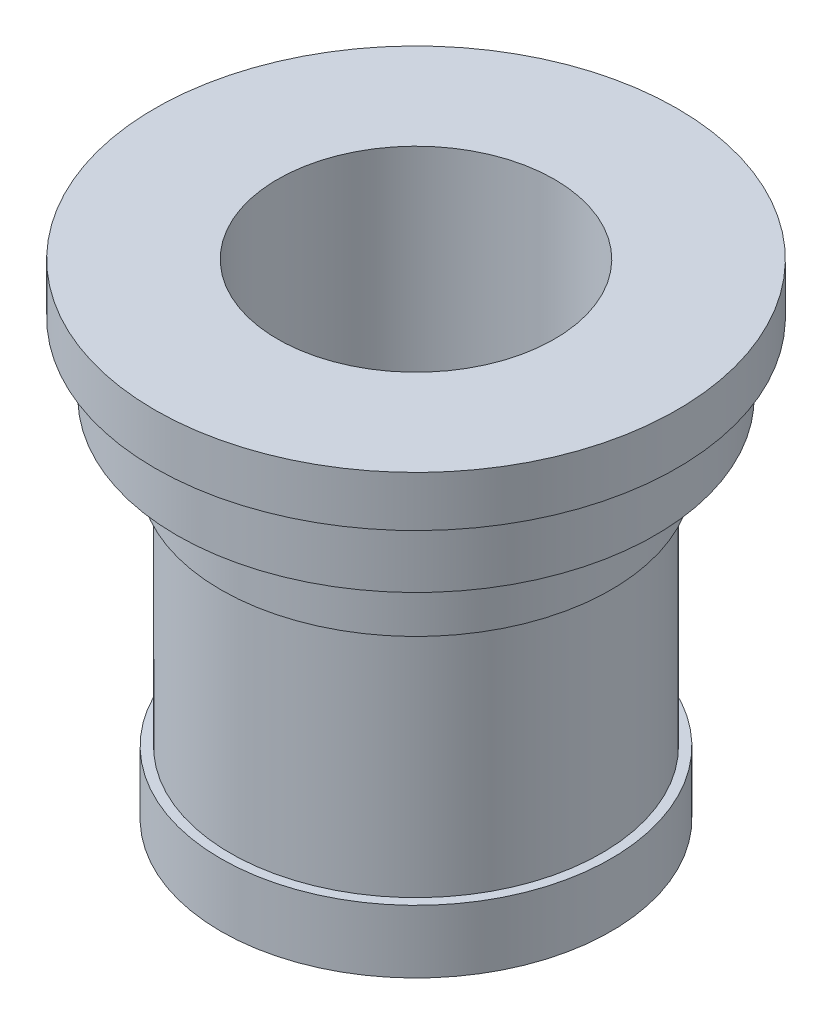
ISO-10303-21;
HEADER;
FILE_DESCRIPTION(('STEP AP214'),'2;1');
FILE_NAME('part.step','',(''),(''),'','','');
FILE_SCHEMA(('AUTOMOTIVE_DESIGN { 1 0 10303 214 1 1 1 1 }'));
ENDSEC;
DATA;
#1=APPLICATION_CONTEXT('core data for automotive mechanical design processes');
#2=APPLICATION_PROTOCOL_DEFINITION('international standard','automotive_design',2000,#1);
#3=PRODUCT_CONTEXT('',#1,'mechanical');
#4=PRODUCT('Part','Part','',(#3));
#5=PRODUCT_RELATED_PRODUCT_CATEGORY('part','',(#4));
#6=PRODUCT_DEFINITION_FORMATION('','',#4);
#7=PRODUCT_DEFINITION_CONTEXT('part definition',#1,'design');
#8=PRODUCT_DEFINITION('design','',#6,#7);
#9=PRODUCT_DEFINITION_SHAPE('','',#8);
#10=(LENGTH_UNIT() NAMED_UNIT(*) SI_UNIT(.MILLI.,.METRE.));
#11=(NAMED_UNIT(*) PLANE_ANGLE_UNIT() SI_UNIT($,.RADIAN.));
#12=(NAMED_UNIT(*) SI_UNIT($,.STERADIAN.) SOLID_ANGLE_UNIT());
#13=UNCERTAINTY_MEASURE_WITH_UNIT(LENGTH_MEASURE(1.E-05),#10,'distance_accuracy_value','');
#14=(GEOMETRIC_REPRESENTATION_CONTEXT(3) GLOBAL_UNCERTAINTY_ASSIGNED_CONTEXT((#13)) GLOBAL_UNIT_ASSIGNED_CONTEXT((#10,
#11,#12)) REPRESENTATION_CONTEXT('',''));
#15=CARTESIAN_POINT('',(0.,0.,0.));
#16=DIRECTION('',(0.,0.,1.));
#17=DIRECTION('',(1.,0.,0.));
#18=AXIS2_PLACEMENT_3D('',#15,#16,#17);
#19=CARTESIAN_POINT('',(0.,0.,0.));
#20=DIRECTION('',(0.,-1.,0.));
#21=DIRECTION('',(0.,0.,-1.));
#22=AXIS2_PLACEMENT_3D('',#19,#20,#21);
#23=CYLINDRICAL_SURFACE('',#22,22.);
#24=CARTESIAN_POINT('',(0.,0.,0.));
#25=DIRECTION('',(0.,-1.,0.));
#26=DIRECTION('',(0.,0.,-1.));
#27=AXIS2_PLACEMENT_3D('',#24,#25,#26);
#28=CIRCLE('',#27,22.);
#29=CARTESIAN_POINT('',(0.,0.,-22.));
#30=VERTEX_POINT('',#29);
#31=EDGE_CURVE('E10',#30,#30,#28,.T.);
#32=ORIENTED_EDGE('',*,*,#31,.T.);
#33=EDGE_LOOP('',(#32));
#34=FACE_BOUND('',#33,.T.);
#35=CARTESIAN_POINT('',(0.,77.,0.));
#36=DIRECTION('',(0.,-1.,0.));
#37=DIRECTION('',(0.,0.,-1.));
#38=AXIS2_PLACEMENT_3D('',#35,#36,#37);
#39=CIRCLE('',#38,22.);
#40=CARTESIAN_POINT('',(0.,77.,-22.));
#41=VERTEX_POINT('',#40);
#42=EDGE_CURVE('E71',#41,#41,#39,.T.);
#43=ORIENTED_EDGE('',*,*,#42,.F.);
#44=EDGE_LOOP('',(#43));
#45=FACE_BOUND('',#44,.T.);
#46=ADVANCED_FACE('F31',(#34,#45),#23,.F.);
#47=CARTESIAN_POINT('',(22.,0.,0.));
#48=DIRECTION('',(0.,-1.,0.));
#49=DIRECTION('',(0.,0.,-1.));
#50=AXIS2_PLACEMENT_3D('',#47,#48,#49);
#51=PLANE('',#50);
#52=CARTESIAN_POINT('',(0.,0.,0.));
#53=DIRECTION('',(0.,-1.,0.));
#54=DIRECTION('',(0.,0.,-1.));
#55=AXIS2_PLACEMENT_3D('',#52,#53,#54);
#56=CIRCLE('',#55,31.);
#57=CARTESIAN_POINT('',(0.,0.,-31.));
#58=VERTEX_POINT('',#57);
#59=EDGE_CURVE('E37',#58,#58,#56,.T.);
#60=ORIENTED_EDGE('',*,*,#59,.T.);
#61=EDGE_LOOP('',(#60));
#62=FACE_BOUND('',#61,.T.);
#63=ORIENTED_EDGE('',*,*,#31,.F.);
#64=EDGE_LOOP('',(#63));
#65=FACE_BOUND('',#64,.T.);
#66=ADVANCED_FACE('F79',(#62,#65),#51,.T.);
#67=CARTESIAN_POINT('',(0.,0.,0.));
#68=DIRECTION('',(0.,-1.,0.));
#69=DIRECTION('',(0.,0.,-1.));
#70=AXIS2_PLACEMENT_3D('',#67,#68,#69);
#71=CYLINDRICAL_SURFACE('',#70,31.);
#72=CARTESIAN_POINT('',(0.,9.99999999999999,0.));
#73=DIRECTION('',(0.,-1.,0.));
#74=DIRECTION('',(0.,0.,-1.));
#75=AXIS2_PLACEMENT_3D('',#72,#73,#74);
#76=CIRCLE('',#75,31.);
#77=CARTESIAN_POINT('',(0.,9.99999999999999,-31.));
#78=VERTEX_POINT('',#77);
#79=EDGE_CURVE('E41',#78,#78,#76,.T.);
#80=ORIENTED_EDGE('',*,*,#79,.T.);
#81=EDGE_LOOP('',(#80));
#82=FACE_BOUND('',#81,.T.);
#83=ORIENTED_EDGE('',*,*,#59,.F.);
#84=EDGE_LOOP('',(#83));
#85=FACE_BOUND('',#84,.T.);
#86=ADVANCED_FACE('F83',(#82,#85),#71,.T.);
#87=CARTESIAN_POINT('',(31.,9.99999999999999,0.));
#88=DIRECTION('',(0.,1.,0.));
#89=DIRECTION('',(0.,0.,1.));
#90=AXIS2_PLACEMENT_3D('',#87,#88,#89);
#91=PLANE('',#90);
#92=CARTESIAN_POINT('',(0.,10.,0.));
#93=DIRECTION('',(0.,-1.,0.));
#94=DIRECTION('',(0.,0.,-1.));
#95=AXIS2_PLACEMENT_3D('',#92,#93,#94);
#96=CIRCLE('',#95,29.5);
#97=CARTESIAN_POINT('',(0.,10.,-29.5));
#98=VERTEX_POINT('',#97);
#99=EDGE_CURVE('E45',#98,#98,#96,.T.);
#100=ORIENTED_EDGE('',*,*,#99,.T.);
#101=EDGE_LOOP('',(#100));
#102=FACE_BOUND('',#101,.T.);
#103=ORIENTED_EDGE('',*,*,#79,.F.);
#104=EDGE_LOOP('',(#103));
#105=FACE_BOUND('',#104,.T.);
#106=ADVANCED_FACE('F87',(#102,#105),#91,.T.);
#107=CARTESIAN_POINT('',(0.,0.,0.));
#108=DIRECTION('',(0.,-1.,0.));
#109=DIRECTION('',(0.,0.,-1.));
#110=AXIS2_PLACEMENT_3D('',#107,#108,#109);
#111=CYLINDRICAL_SURFACE('',#110,29.5);
#112=CARTESIAN_POINT('',(0.,47.,0.));
#113=DIRECTION('',(0.,-1.,0.));
#114=DIRECTION('',(0.,0.,-1.));
#115=AXIS2_PLACEMENT_3D('',#112,#113,#114);
#116=CIRCLE('',#115,29.5);
#117=CARTESIAN_POINT('',(0.,47.,-29.5));
#118=VERTEX_POINT('',#117);
#119=EDGE_CURVE('E50',#118,#118,#116,.T.);
#120=ORIENTED_EDGE('',*,*,#119,.T.);
#121=EDGE_LOOP('',(#120));
#122=FACE_BOUND('',#121,.T.);
#123=ORIENTED_EDGE('',*,*,#99,.F.);
#124=EDGE_LOOP('',(#123));
#125=FACE_BOUND('',#124,.T.);
#126=ADVANCED_FACE('F94',(#122,#125),#111,.T.);
#127=CARTESIAN_POINT('',(29.5,47.,0.));
#128=DIRECTION('',(0.,-1.,0.));
#129=DIRECTION('',(0.,0.,-1.));
#130=AXIS2_PLACEMENT_3D('',#127,#128,#129);
#131=PLANE('',#130);
#132=CARTESIAN_POINT('',(0.,47.,0.));
#133=DIRECTION('',(0.,-1.,0.));
#134=DIRECTION('',(0.,0.,-1.));
#135=AXIS2_PLACEMENT_3D('',#132,#133,#134);
#136=CIRCLE('',#135,31.);
#137=CARTESIAN_POINT('',(0.,47.,-31.));
#138=VERTEX_POINT('',#137);
#139=EDGE_CURVE('E53',#138,#138,#136,.T.);
#140=ORIENTED_EDGE('',*,*,#139,.T.);
#141=EDGE_LOOP('',(#140));
#142=FACE_BOUND('',#141,.T.);
#143=ORIENTED_EDGE('',*,*,#119,.F.);
#144=EDGE_LOOP('',(#143));
#145=FACE_BOUND('',#144,.T.);
#146=ADVANCED_FACE('F98',(#142,#145),#131,.T.);
#147=CARTESIAN_POINT('',(0.,0.,0.));
#148=DIRECTION('',(0.,-1.,0.));
#149=DIRECTION('',(0.,0.,-1.));
#150=AXIS2_PLACEMENT_3D('',#147,#148,#149);
#151=CYLINDRICAL_SURFACE('',#150,31.);
#152=CARTESIAN_POINT('',(0.,58.,0.));
#153=DIRECTION('',(0.,-1.,0.));
#154=DIRECTION('',(0.,0.,-1.));
#155=AXIS2_PLACEMENT_3D('',#152,#153,#154);
#156=CIRCLE('',#155,31.);
#157=CARTESIAN_POINT('',(0.,58.,-31.));
#158=VERTEX_POINT('',#157);
#159=EDGE_CURVE('E56',#158,#158,#156,.T.);
#160=ORIENTED_EDGE('',*,*,#159,.T.);
#161=EDGE_LOOP('',(#160));
#162=FACE_BOUND('',#161,.T.);
#163=ORIENTED_EDGE('',*,*,#139,.F.);
#164=EDGE_LOOP('',(#163));
#165=FACE_BOUND('',#164,.T.);
#166=ADVANCED_FACE('F102',(#162,#165),#151,.T.);
#167=CARTESIAN_POINT('',(31.,58.,0.));
#168=DIRECTION('',(0.,-1.,0.));
#169=DIRECTION('',(0.,0.,-1.));
#170=AXIS2_PLACEMENT_3D('',#167,#168,#169);
#171=PLANE('',#170);
#172=CARTESIAN_POINT('',(0.,58.,0.));
#173=DIRECTION('',(0.,-1.,0.));
#174=DIRECTION('',(0.,0.,-1.));
#175=AXIS2_PLACEMENT_3D('',#172,#173,#174);
#176=CIRCLE('',#175,38.);
#177=CARTESIAN_POINT('',(0.,58.,-38.));
#178=VERTEX_POINT('',#177);
#179=EDGE_CURVE('E59',#178,#178,#176,.T.);
#180=ORIENTED_EDGE('',*,*,#179,.T.);
#181=EDGE_LOOP('',(#180));
#182=FACE_BOUND('',#181,.T.);
#183=ORIENTED_EDGE('',*,*,#159,.F.);
#184=EDGE_LOOP('',(#183));
#185=FACE_BOUND('',#184,.T.);
#186=ADVANCED_FACE('F106',(#182,#185),#171,.T.);
#187=CARTESIAN_POINT('',(0.,0.,0.));
#188=DIRECTION('',(0.,-1.,0.));
#189=DIRECTION('',(0.,0.,-1.));
#190=AXIS2_PLACEMENT_3D('',#187,#188,#189);
#191=CYLINDRICAL_SURFACE('',#190,38.);
#192=CARTESIAN_POINT('',(0.,69.,0.));
#193=DIRECTION('',(0.,-1.,0.));
#194=DIRECTION('',(0.,0.,-1.));
#195=AXIS2_PLACEMENT_3D('',#192,#193,#194);
#196=CIRCLE('',#195,38.);
#197=CARTESIAN_POINT('',(0.,69.,-38.));
#198=VERTEX_POINT('',#197);
#199=EDGE_CURVE('E62',#198,#198,#196,.T.);
#200=ORIENTED_EDGE('',*,*,#199,.T.);
#201=EDGE_LOOP('',(#200));
#202=FACE_BOUND('',#201,.T.);
#203=ORIENTED_EDGE('',*,*,#179,.F.);
#204=EDGE_LOOP('',(#203));
#205=FACE_BOUND('',#204,.T.);
#206=ADVANCED_FACE('F110',(#202,#205),#191,.T.);
#207=CARTESIAN_POINT('',(38.,69.,0.));
#208=DIRECTION('',(0.,-1.,0.));
#209=DIRECTION('',(0.,0.,-1.));
#210=AXIS2_PLACEMENT_3D('',#207,#208,#209);
#211=PLANE('',#210);
#212=CARTESIAN_POINT('',(0.,69.,0.));
#213=DIRECTION('',(0.,-1.,0.));
#214=DIRECTION('',(0.,0.,-1.));
#215=AXIS2_PLACEMENT_3D('',#212,#213,#214);
#216=CIRCLE('',#215,41.5);
#217=CARTESIAN_POINT('',(0.,69.,-41.5));
#218=VERTEX_POINT('',#217);
#219=EDGE_CURVE('E65',#218,#218,#216,.T.);
#220=ORIENTED_EDGE('',*,*,#219,.T.);
#221=EDGE_LOOP('',(#220));
#222=FACE_BOUND('',#221,.T.);
#223=ORIENTED_EDGE('',*,*,#199,.F.);
#224=EDGE_LOOP('',(#223));
#225=FACE_BOUND('',#224,.T.);
#226=ADVANCED_FACE('F114',(#222,#225),#211,.T.);
#227=CARTESIAN_POINT('',(0.,0.,0.));
#228=DIRECTION('',(0.,-1.,0.));
#229=DIRECTION('',(0.,0.,-1.));
#230=AXIS2_PLACEMENT_3D('',#227,#228,#229);
#231=CYLINDRICAL_SURFACE('',#230,41.5);
#232=CARTESIAN_POINT('',(0.,77.,0.));
#233=DIRECTION('',(0.,-1.,0.));
#234=DIRECTION('',(0.,0.,-1.));
#235=AXIS2_PLACEMENT_3D('',#232,#233,#234);
#236=CIRCLE('',#235,41.5);
#237=CARTESIAN_POINT('',(0.,77.,-41.5));
#238=VERTEX_POINT('',#237);
#239=EDGE_CURVE('E68',#238,#238,#236,.T.);
#240=ORIENTED_EDGE('',*,*,#239,.T.);
#241=EDGE_LOOP('',(#240));
#242=FACE_BOUND('',#241,.T.);
#243=ORIENTED_EDGE('',*,*,#219,.F.);
#244=EDGE_LOOP('',(#243));
#245=FACE_BOUND('',#244,.T.);
#246=ADVANCED_FACE('F118',(#242,#245),#231,.T.);
#247=CARTESIAN_POINT('',(41.5,77.,0.));
#248=DIRECTION('',(0.,1.,0.));
#249=DIRECTION('',(0.,0.,1.));
#250=AXIS2_PLACEMENT_3D('',#247,#248,#249);
#251=PLANE('',#250);
#252=ORIENTED_EDGE('',*,*,#42,.T.);
#253=EDGE_LOOP('',(#252));
#254=FACE_BOUND('',#253,.T.);
#255=ORIENTED_EDGE('',*,*,#239,.F.);
#256=EDGE_LOOP('',(#255));
#257=FACE_BOUND('',#256,.T.);
#258=ADVANCED_FACE('F75',(#254,#257),#251,.T.);
#259=CLOSED_SHELL('',(#46,#66,#86,#106,#126,#146,#166,#186,#206,#226,#246,#258));
#260=MANIFOLD_SOLID_BREP('B2',#259);
#261=ADVANCED_BREP_SHAPE_REPRESENTATION('',(#18,#260),#14);
#262=SHAPE_DEFINITION_REPRESENTATION(#9,#261);
ENDSEC;
END-ISO-10303-21;
